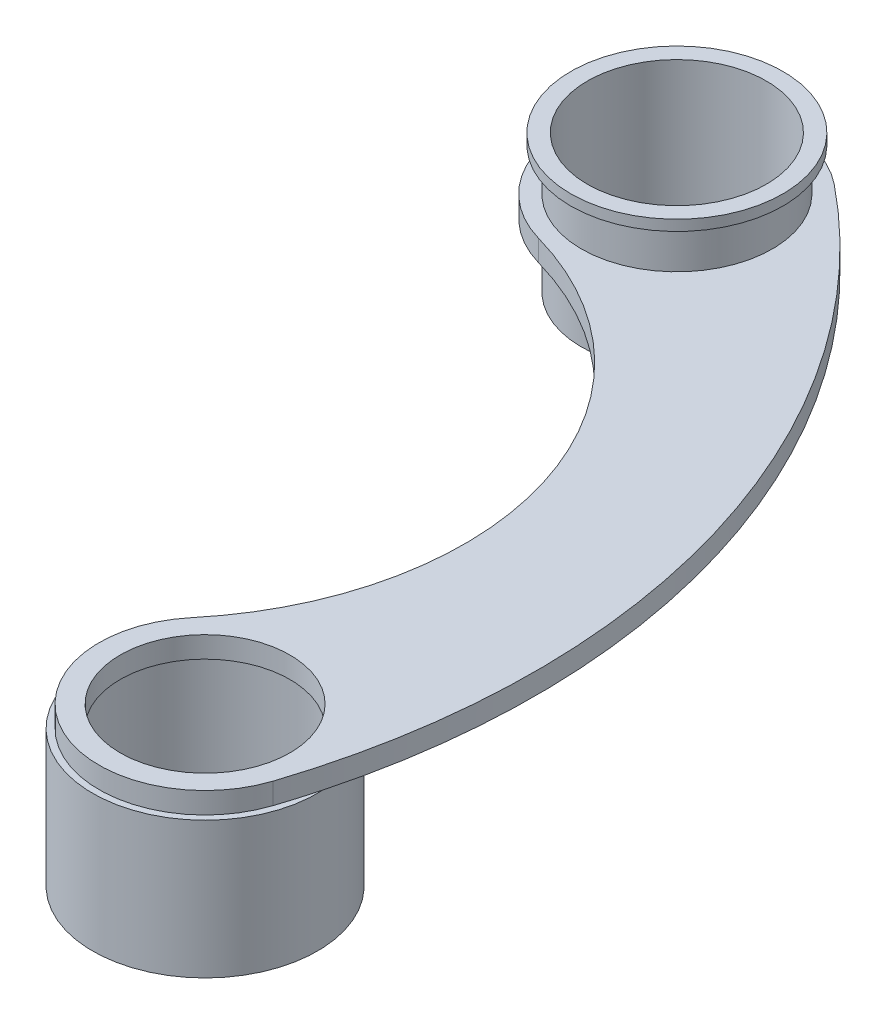
ISO-10303-21;
HEADER;
FILE_DESCRIPTION(('STEP AP214'),'2;1');
FILE_NAME('part.step','',(''),(''),'','','');
FILE_SCHEMA(('AUTOMOTIVE_DESIGN { 1 0 10303 214 1 1 1 1 }'));
ENDSEC;
DATA;
#1=APPLICATION_CONTEXT('core data for automotive mechanical design processes');
#2=APPLICATION_PROTOCOL_DEFINITION('international standard','automotive_design',2000,#1);
#3=PRODUCT_CONTEXT('',#1,'mechanical');
#4=PRODUCT('Part','Part','',(#3));
#5=PRODUCT_RELATED_PRODUCT_CATEGORY('part','',(#4));
#6=PRODUCT_DEFINITION_FORMATION('','',#4);
#7=PRODUCT_DEFINITION_CONTEXT('part definition',#1,'design');
#8=PRODUCT_DEFINITION('design','',#6,#7);
#9=PRODUCT_DEFINITION_SHAPE('','',#8);
#10=(LENGTH_UNIT() NAMED_UNIT(*) SI_UNIT(.MILLI.,.METRE.));
#11=(NAMED_UNIT(*) PLANE_ANGLE_UNIT() SI_UNIT($,.RADIAN.));
#12=(NAMED_UNIT(*) SI_UNIT($,.STERADIAN.) SOLID_ANGLE_UNIT());
#13=UNCERTAINTY_MEASURE_WITH_UNIT(LENGTH_MEASURE(1.E-05),#10,'distance_accuracy_value','');
#14=(GEOMETRIC_REPRESENTATION_CONTEXT(3) GLOBAL_UNCERTAINTY_ASSIGNED_CONTEXT((#13)) GLOBAL_UNIT_ASSIGNED_CONTEXT((#10,
#11,#12)) REPRESENTATION_CONTEXT('',''));
#15=CARTESIAN_POINT('',(0.,0.,0.));
#16=DIRECTION('',(0.,0.,1.));
#17=DIRECTION('',(1.,0.,0.));
#18=AXIS2_PLACEMENT_3D('',#15,#16,#17);
#19=CARTESIAN_POINT('',(9.69812358716446,-0.1,31.9326861666704));
#20=DIRECTION('',(0.,-1.,0.));
#21=DIRECTION('',(0.,0.,-1.));
#22=AXIS2_PLACEMENT_3D('',#19,#20,#21);
#23=PLANE('',#22);
#24=CARTESIAN_POINT('',(9.69812358716446,-0.1,31.9326861666704));
#25=DIRECTION('',(0.,-1.,0.));
#26=DIRECTION('',(0.,0.,-1.));
#27=AXIS2_PLACEMENT_3D('',#24,#25,#26);
#28=CIRCLE('',#27,4.5);
#29=CARTESIAN_POINT('',(9.69812358716446,-0.1,27.4326861666704));
#30=VERTEX_POINT('',#29);
#31=EDGE_CURVE('E114',#30,#30,#28,.T.);
#32=ORIENTED_EDGE('',*,*,#31,.F.);
#33=EDGE_LOOP('',(#32));
#34=FACE_BOUND('',#33,.T.);
#35=CARTESIAN_POINT('',(9.69812358716446,-0.1,31.9326861666704));
#36=DIRECTION('',(0.,-1.,0.));
#37=DIRECTION('',(0.,0.,-1.));
#38=AXIS2_PLACEMENT_3D('',#35,#36,#37);
#39=CIRCLE('',#38,5.00000000000001);
#40=CARTESIAN_POINT('',(9.69812358716446,-0.1,26.9326861666704));
#41=VERTEX_POINT('',#40);
#42=EDGE_CURVE('E12',#41,#41,#39,.F.);
#43=ORIENTED_EDGE('',*,*,#42,.F.);
#44=EDGE_LOOP('',(#43));
#45=FACE_BOUND('',#44,.T.);
#46=ADVANCED_FACE('F47',(#34,#45),#23,.T.);
#47=CARTESIAN_POINT('',(-4.35036872643945,0.,27.3541172356111));
#48=DIRECTION('',(0.,1.,0.));
#49=DIRECTION('',(0.,0.,1.));
#50=AXIS2_PLACEMENT_3D('',#47,#48,#49);
#51=PLANE('',#50);
#52=CARTESIAN_POINT('',(9.69812358716446,0.,31.9326861666704));
#53=DIRECTION('',(0.,1.,0.));
#54=DIRECTION('',(0.,0.,1.));
#55=AXIS2_PLACEMENT_3D('',#52,#53,#54);
#56=CIRCLE('',#55,4.);
#57=CARTESIAN_POINT('',(9.69812358716446,0.,35.9326861666704));
#58=VERTEX_POINT('',#57);
#59=EDGE_CURVE('E144',#58,#58,#56,.T.);
#60=ORIENTED_EDGE('',*,*,#59,.T.);
#61=EDGE_LOOP('',(#60));
#62=FACE_BOUND('',#61,.T.);
#63=CARTESIAN_POINT('',(9.69812358716446,0.,31.9326861666704));
#64=DIRECTION('',(0.,-1.,0.));
#65=DIRECTION('',(0.,0.,-1.));
#66=AXIS2_PLACEMENT_3D('',#63,#64,#65);
#67=CIRCLE('',#66,4.5);
#68=CARTESIAN_POINT('',(9.69812358716446,0.,27.4326861666704));
#69=VERTEX_POINT('',#68);
#70=EDGE_CURVE('E384',#69,#69,#67,.T.);
#71=ORIENTED_EDGE('',*,*,#70,.T.);
#72=EDGE_LOOP('',(#71));
#73=FACE_BOUND('',#72,.T.);
#74=ADVANCED_FACE('F181',(#62,#73),#51,.F.);
#75=CARTESIAN_POINT('',(-4.35036872643945,1.,27.3541172356111));
#76=DIRECTION('',(0.,1.,0.));
#77=DIRECTION('',(0.,0.,1.));
#78=AXIS2_PLACEMENT_3D('',#75,#76,#77);
#79=PLANE('',#78);
#80=CARTESIAN_POINT('',(0.,1.,0.));
#81=DIRECTION('',(0.,1.,0.));
#82=DIRECTION('',(0.,0.,1.));
#83=AXIS2_PLACEMENT_3D('',#80,#81,#82);
#84=CIRCLE('',#83,4.5);
#85=CARTESIAN_POINT('',(0.,1.,4.5));
#86=VERTEX_POINT('',#85);
#87=EDGE_CURVE('E56',#86,#86,#84,.T.);
#88=ORIENTED_EDGE('',*,*,#87,.F.);
#89=EDGE_LOOP('',(#88));
#90=FACE_BOUND('',#89,.T.);
#91=CARTESIAN_POINT('',(9.69812358716446,1.,31.9326861666704));
#92=DIRECTION('',(0.,1.,0.));
#93=DIRECTION('',(0.,0.,1.));
#94=AXIS2_PLACEMENT_3D('',#91,#92,#93);
#95=CIRCLE('',#94,5.);
#96=CARTESIAN_POINT('',(5.85849379907024,1.,28.7299930670464));
#97=VERTEX_POINT('',#96);
#98=CARTESIAN_POINT('',(14.4520182011324,1.,33.4820363528086));
#99=VERTEX_POINT('',#98);
#100=EDGE_CURVE('E134',#97,#99,#95,.T.);
#101=ORIENTED_EDGE('',*,*,#100,.T.);
#102=CARTESIAN_POINT('',(-18.3988610400434,1.,22.7755483045518));
#103=DIRECTION('',(0.,1.,0.));
#104=DIRECTION('',(0.,0.,1.));
#105=AXIS2_PLACEMENT_3D('',#102,#103,#104);
#106=CIRCLE('',#105,34.5515434278381);
#107=CARTESIAN_POINT('',(3.31345958167143,1.,-4.10165925995602));
#108=VERTEX_POINT('',#107);
#109=EDGE_CURVE('E95',#99,#108,#106,.T.);
#110=ORIENTED_EDGE('',*,*,#109,.T.);
#111=CARTESIAN_POINT('',(0.,1.,0.));
#112=DIRECTION('',(0.,1.,0.));
#113=DIRECTION('',(0.,0.,1.));
#114=AXIS2_PLACEMENT_3D('',#111,#112,#113);
#115=CIRCLE('',#114,5.2728192728514);
#116=CARTESIAN_POINT('',(-1.44187506492091,1.,5.07184575685347));
#117=VERTEX_POINT('',#116);
#118=EDGE_CURVE('E166',#108,#117,#115,.T.);
#119=ORIENTED_EDGE('',*,*,#118,.T.);
#120=CARTESIAN_POINT('',(-5.47914827198229,1.,19.2730948682775));
#121=DIRECTION('',(0.,-1.,0.));
#122=DIRECTION('',(0.,0.,1.));
#123=AXIS2_PLACEMENT_3D('',#120,#121,#122);
#124=CIRCLE('',#123,14.7639781655615);
#125=EDGE_CURVE('E64',#117,#97,#124,.T.);
#126=ORIENTED_EDGE('',*,*,#125,.T.);
#127=EDGE_LOOP('',(#101,#110,#119,#126));
#128=FACE_BOUND('',#127,.T.);
#129=CARTESIAN_POINT('',(9.69812358716446,1.,31.9326861666704));
#130=DIRECTION('',(0.,1.,0.));
#131=DIRECTION('',(0.,0.,1.));
#132=AXIS2_PLACEMENT_3D('',#129,#130,#131);
#133=CIRCLE('',#132,4.);
#134=CARTESIAN_POINT('',(9.69812358716446,1.,35.9326861666704));
#135=VERTEX_POINT('',#134);
#136=EDGE_CURVE('E148',#135,#135,#133,.T.);
#137=ORIENTED_EDGE('',*,*,#136,.F.);
#138=EDGE_LOOP('',(#137));
#139=FACE_BOUND('',#138,.T.);
#140=ADVANCED_FACE('F168',(#90,#128,#139),#79,.T.);
#141=CARTESIAN_POINT('',(9.69812358716446,0.,31.9326861666704));
#142=DIRECTION('',(0.,-1.,0.));
#143=DIRECTION('',(0.,0.,-1.));
#144=AXIS2_PLACEMENT_3D('',#141,#142,#143);
#145=CIRCLE('',#144,5.3);
#146=CARTESIAN_POINT('',(6.77034485747711,0.,27.5147554621448));
#147=VERTEX_POINT('',#146);
#148=CARTESIAN_POINT('',(14.9910697764943,0.,31.6593354087439));
#149=VERTEX_POINT('',#148);
#150=EDGE_CURVE('E105',#147,#149,#145,.T.);
#151=ORIENTED_EDGE('',*,*,#150,.F.);
#152=CARTESIAN_POINT('',(-5.47914827198229,0.,19.2730948682775));
#153=DIRECTION('',(0.,-1.,0.));
#154=DIRECTION('',(0.,0.,1.));
#155=AXIS2_PLACEMENT_3D('',#152,#153,#154);
#156=CIRCLE('',#155,14.7639781655615);
#157=CARTESIAN_POINT('',(-1.44187506492091,0.,5.07184575685347));
#158=VERTEX_POINT('',#157);
#159=EDGE_CURVE('E132',#158,#147,#156,.T.);
#160=ORIENTED_EDGE('',*,*,#159,.F.);
#161=CARTESIAN_POINT('',(0.,0.,0.));
#162=DIRECTION('',(0.,1.,0.));
#163=DIRECTION('',(0.,0.,1.));
#164=AXIS2_PLACEMENT_3D('',#161,#162,#163);
#165=CIRCLE('',#164,5.2728192728514);
#166=CARTESIAN_POINT('',(3.31345958167143,0.,-4.10165925995602));
#167=VERTEX_POINT('',#166);
#168=EDGE_CURVE('E79',#167,#158,#165,.T.);
#169=ORIENTED_EDGE('',*,*,#168,.F.);
#170=CARTESIAN_POINT('',(-18.3988610400434,0.,22.7755483045518));
#171=DIRECTION('',(0.,1.,0.));
#172=DIRECTION('',(0.,0.,1.));
#173=AXIS2_PLACEMENT_3D('',#170,#171,#172);
#174=CIRCLE('',#173,34.5515434278381);
#175=EDGE_CURVE('E121',#149,#167,#174,.T.);
#176=ORIENTED_EDGE('',*,*,#175,.F.);
#177=EDGE_LOOP('',(#151,#160,#169,#176));
#178=FACE_BOUND('',#177,.T.);
#179=CARTESIAN_POINT('',(0.,0.,0.));
#180=DIRECTION('',(0.,1.,0.));
#181=DIRECTION('',(0.,0.,1.));
#182=AXIS2_PLACEMENT_3D('',#179,#180,#181);
#183=CIRCLE('',#182,4.5);
#184=CARTESIAN_POINT('',(0.,0.,4.5));
#185=VERTEX_POINT('',#184);
#186=EDGE_CURVE('E142',#185,#185,#183,.T.);
#187=ORIENTED_EDGE('',*,*,#186,.T.);
#188=EDGE_LOOP('',(#187));
#189=FACE_BOUND('',#188,.T.);
#190=ADVANCED_FACE('F122',(#178,#189),#51,.F.);
#191=CARTESIAN_POINT('',(9.69812358716446,1.,31.9326861666704));
#192=DIRECTION('',(0.,-1.,0.));
#193=DIRECTION('',(0.,0.,-1.));
#194=AXIS2_PLACEMENT_3D('',#191,#192,#193);
#195=CYLINDRICAL_SURFACE('',#194,5.);
#196=CARTESIAN_POINT('',(9.69812358716446,0.,31.9326861666704));
#197=DIRECTION('',(0.,1.,0.));
#198=DIRECTION('',(0.,0.,1.));
#199=AXIS2_PLACEMENT_3D('',#196,#197,#198);
#200=CIRCLE('',#199,5.);
#201=CARTESIAN_POINT('',(5.85849379907024,0.,28.7299930670464));
#202=VERTEX_POINT('',#201);
#203=CARTESIAN_POINT('',(14.4520182011324,0.,33.4820363528086));
#204=VERTEX_POINT('',#203);
#205=EDGE_CURVE('E87',#202,#204,#200,.T.);
#206=ORIENTED_EDGE('',*,*,#205,.T.);
#207=DIRECTION('',(0.,-1.,0.));
#208=VECTOR('',#207,1.);
#209=CARTESIAN_POINT('',(14.4520182011324,1.,33.4820363528086));
#210=LINE('',#209,#208);
#211=EDGE_CURVE('E127',#99,#204,#210,.T.);
#212=ORIENTED_EDGE('',*,*,#211,.F.);
#213=ORIENTED_EDGE('',*,*,#100,.F.);
#214=DIRECTION('',(0.,-1.,0.));
#215=VECTOR('',#214,1.);
#216=CARTESIAN_POINT('',(5.85849379907024,1.,28.7299930670464));
#217=LINE('',#216,#215);
#218=EDGE_CURVE('E135',#97,#202,#217,.T.);
#219=ORIENTED_EDGE('',*,*,#218,.T.);
#220=EDGE_LOOP('',(#206,#212,#213,#219));
#221=FACE_BOUND('',#220,.T.);
#222=ADVANCED_FACE('F49',(#221),#195,.T.);
#223=CARTESIAN_POINT('',(-18.3988610400434,1.,22.7755483045518));
#224=DIRECTION('',(0.,-1.,0.));
#225=DIRECTION('',(0.,0.,-1.));
#226=AXIS2_PLACEMENT_3D('',#223,#224,#225);
#227=CYLINDRICAL_SURFACE('',#226,34.5515434278381);
#228=EDGE_CURVE('E118',#204,#149,#174,.T.);
#229=ORIENTED_EDGE('',*,*,#228,.T.);
#230=ORIENTED_EDGE('',*,*,#175,.T.);
#231=DIRECTION('',(0.,-1.,0.));
#232=VECTOR('',#231,1.);
#233=CARTESIAN_POINT('',(3.31345958167143,1.,-4.10165925995602));
#234=LINE('',#233,#232);
#235=EDGE_CURVE('E140',#108,#167,#234,.T.);
#236=ORIENTED_EDGE('',*,*,#235,.F.);
#237=ORIENTED_EDGE('',*,*,#109,.F.);
#238=ORIENTED_EDGE('',*,*,#211,.T.);
#239=EDGE_LOOP('',(#229,#230,#236,#237,#238));
#240=FACE_BOUND('',#239,.T.);
#241=ADVANCED_FACE('F125',(#240),#227,.T.);
#242=CARTESIAN_POINT('',(0.,1.,0.));
#243=DIRECTION('',(0.,-1.,0.));
#244=DIRECTION('',(0.,0.,-1.));
#245=AXIS2_PLACEMENT_3D('',#242,#243,#244);
#246=CYLINDRICAL_SURFACE('',#245,5.2728192728514);
#247=ORIENTED_EDGE('',*,*,#168,.T.);
#248=DIRECTION('',(0.,-1.,0.));
#249=VECTOR('',#248,1.);
#250=CARTESIAN_POINT('',(-1.44187506492091,1.,5.07184575685347));
#251=LINE('',#250,#249);
#252=EDGE_CURVE('E138',#117,#158,#251,.T.);
#253=ORIENTED_EDGE('',*,*,#252,.F.);
#254=ORIENTED_EDGE('',*,*,#118,.F.);
#255=ORIENTED_EDGE('',*,*,#235,.T.);
#256=EDGE_LOOP('',(#247,#253,#254,#255));
#257=FACE_BOUND('',#256,.T.);
#258=ADVANCED_FACE('F170',(#257),#246,.T.);
#259=CARTESIAN_POINT('',(-5.47914827198229,1.,19.2730948682775));
#260=DIRECTION('',(0.,-1.,0.));
#261=DIRECTION('',(0.,0.,-1.));
#262=AXIS2_PLACEMENT_3D('',#259,#260,#261);
#263=CYLINDRICAL_SURFACE('',#262,14.7639781655615);
#264=ORIENTED_EDGE('',*,*,#159,.T.);
#265=EDGE_CURVE('E119',#147,#202,#156,.T.);
#266=ORIENTED_EDGE('',*,*,#265,.T.);
#267=ORIENTED_EDGE('',*,*,#218,.F.);
#268=ORIENTED_EDGE('',*,*,#125,.F.);
#269=ORIENTED_EDGE('',*,*,#252,.T.);
#270=EDGE_LOOP('',(#264,#266,#267,#268,#269));
#271=FACE_BOUND('',#270,.T.);
#272=ADVANCED_FACE('F172',(#271),#263,.F.);
#273=CARTESIAN_POINT('',(9.69812358716446,1.,31.9326861666704));
#274=DIRECTION('',(0.,-1.,0.));
#275=DIRECTION('',(0.,0.,-1.));
#276=AXIS2_PLACEMENT_3D('',#273,#274,#275);
#277=CYLINDRICAL_SURFACE('',#276,4.);
#278=ORIENTED_EDGE('',*,*,#136,.T.);
#279=EDGE_LOOP('',(#278));
#280=FACE_BOUND('',#279,.T.);
#281=ORIENTED_EDGE('',*,*,#59,.F.);
#282=EDGE_LOOP('',(#281));
#283=FACE_BOUND('',#282,.T.);
#284=ADVANCED_FACE('F221',(#280,#283),#277,.F.);
#285=CARTESIAN_POINT('',(0.,-3.,0.));
#286=DIRECTION('',(0.,1.,0.));
#287=DIRECTION('',(0.,0.,1.));
#288=AXIS2_PLACEMENT_3D('',#285,#286,#287);
#289=CYLINDRICAL_SURFACE('',#288,4.5);
#290=CARTESIAN_POINT('',(0.,-3.,0.));
#291=DIRECTION('',(0.,1.,0.));
#292=DIRECTION('',(0.,0.,1.));
#293=AXIS2_PLACEMENT_3D('',#290,#291,#292);
#294=CIRCLE('',#293,4.5);
#295=CARTESIAN_POINT('',(0.,-3.,4.5));
#296=VERTEX_POINT('',#295);
#297=EDGE_CURVE('E145',#296,#296,#294,.T.);
#298=ORIENTED_EDGE('',*,*,#297,.T.);
#299=EDGE_LOOP('',(#298));
#300=FACE_BOUND('',#299,.T.);
#301=ORIENTED_EDGE('',*,*,#186,.F.);
#302=EDGE_LOOP('',(#301));
#303=FACE_BOUND('',#302,.T.);
#304=ADVANCED_FACE('F216',(#300,#303),#289,.T.);
#305=CARTESIAN_POINT('',(0.,-3.,0.));
#306=DIRECTION('',(0.,1.,0.));
#307=DIRECTION('',(0.,0.,1.));
#308=AXIS2_PLACEMENT_3D('',#305,#306,#307);
#309=PLANE('',#308);
#310=CARTESIAN_POINT('',(0.,-3.,0.));
#311=DIRECTION('',(0.,1.,0.));
#312=DIRECTION('',(0.,0.,1.));
#313=AXIS2_PLACEMENT_3D('',#310,#311,#312);
#314=CIRCLE('',#313,4.21825541828112);
#315=CARTESIAN_POINT('',(0.,-3.,4.21825541828112));
#316=VERTEX_POINT('',#315);
#317=EDGE_CURVE('E151',#316,#316,#314,.T.);
#318=ORIENTED_EDGE('',*,*,#317,.T.);
#319=EDGE_LOOP('',(#318));
#320=FACE_BOUND('',#319,.T.);
#321=ORIENTED_EDGE('',*,*,#297,.F.);
#322=EDGE_LOOP('',(#321));
#323=FACE_BOUND('',#322,.T.);
#324=ADVANCED_FACE('F212',(#320,#323),#309,.F.);
#325=CARTESIAN_POINT('',(0.,1.,0.));
#326=DIRECTION('',(0.,-1.,0.));
#327=DIRECTION('',(0.,0.,-1.));
#328=AXIS2_PLACEMENT_3D('',#325,#326,#327);
#329=CYLINDRICAL_SURFACE('',#328,4.21825541828112);
#330=ORIENTED_EDGE('',*,*,#317,.F.);
#331=EDGE_LOOP('',(#330));
#332=FACE_BOUND('',#331,.T.);
#333=CARTESIAN_POINT('',(0.,3.5,0.));
#334=DIRECTION('',(0.,1.,0.));
#335=DIRECTION('',(0.,0.,1.));
#336=AXIS2_PLACEMENT_3D('',#333,#334,#335);
#337=CIRCLE('',#336,4.21825541828112);
#338=CARTESIAN_POINT('',(0.,3.5,4.21825541828112));
#339=VERTEX_POINT('',#338);
#340=EDGE_CURVE('E120',#339,#339,#337,.T.);
#341=ORIENTED_EDGE('',*,*,#340,.T.);
#342=EDGE_LOOP('',(#341));
#343=FACE_BOUND('',#342,.T.);
#344=ADVANCED_FACE('F215',(#332,#343),#329,.F.);
#345=ORIENTED_EDGE('',*,*,#87,.T.);
#346=EDGE_LOOP('',(#345));
#347=FACE_BOUND('',#346,.T.);
#348=CARTESIAN_POINT('',(0.,3.,0.));
#349=DIRECTION('',(0.,1.,0.));
#350=DIRECTION('',(0.,0.,1.));
#351=AXIS2_PLACEMENT_3D('',#348,#349,#350);
#352=CIRCLE('',#351,4.5);
#353=CARTESIAN_POINT('',(0.,3.,4.5));
#354=VERTEX_POINT('',#353);
#355=EDGE_CURVE('E156',#354,#354,#352,.T.);
#356=ORIENTED_EDGE('',*,*,#355,.F.);
#357=EDGE_LOOP('',(#356));
#358=FACE_BOUND('',#357,.T.);
#359=ADVANCED_FACE('F204',(#347,#358),#289,.T.);
#360=CARTESIAN_POINT('',(0.,3.5,0.));
#361=DIRECTION('',(0.,1.,0.));
#362=DIRECTION('',(0.,0.,1.));
#363=AXIS2_PLACEMENT_3D('',#360,#361,#362);
#364=PLANE('',#363);
#365=CARTESIAN_POINT('',(0.,3.5,0.));
#366=DIRECTION('',(0.,1.,0.));
#367=DIRECTION('',(0.,0.,1.));
#368=AXIS2_PLACEMENT_3D('',#365,#366,#367);
#369=CIRCLE('',#368,5.);
#370=CARTESIAN_POINT('',(0.,3.5,5.));
#371=VERTEX_POINT('',#370);
#372=EDGE_CURVE('E394',#371,#371,#369,.T.);
#373=ORIENTED_EDGE('',*,*,#372,.T.);
#374=EDGE_LOOP('',(#373));
#375=FACE_BOUND('',#374,.T.);
#376=ORIENTED_EDGE('',*,*,#340,.F.);
#377=EDGE_LOOP('',(#376));
#378=FACE_BOUND('',#377,.T.);
#379=ADVANCED_FACE('F200',(#375,#378),#364,.T.);
#380=CARTESIAN_POINT('',(0.,3.,0.));
#381=DIRECTION('',(0.,1.,0.));
#382=DIRECTION('',(0.,0.,1.));
#383=AXIS2_PLACEMENT_3D('',#380,#381,#382);
#384=PLANE('',#383);
#385=ORIENTED_EDGE('',*,*,#355,.T.);
#386=EDGE_LOOP('',(#385));
#387=FACE_BOUND('',#386,.T.);
#388=CARTESIAN_POINT('',(0.,3.,0.));
#389=DIRECTION('',(0.,1.,0.));
#390=DIRECTION('',(0.,0.,1.));
#391=AXIS2_PLACEMENT_3D('',#388,#389,#390);
#392=CIRCLE('',#391,5.);
#393=CARTESIAN_POINT('',(0.,3.,5.));
#394=VERTEX_POINT('',#393);
#395=EDGE_CURVE('E393',#394,#394,#392,.T.);
#396=ORIENTED_EDGE('',*,*,#395,.F.);
#397=EDGE_LOOP('',(#396));
#398=FACE_BOUND('',#397,.T.);
#399=ADVANCED_FACE('F203',(#387,#398),#384,.F.);
#400=CARTESIAN_POINT('',(0.,3.5,0.));
#401=DIRECTION('',(0.,-1.,0.));
#402=DIRECTION('',(0.,0.,-1.));
#403=AXIS2_PLACEMENT_3D('',#400,#401,#402);
#404=CYLINDRICAL_SURFACE('',#403,5.);
#405=ORIENTED_EDGE('',*,*,#372,.F.);
#406=EDGE_LOOP('',(#405));
#407=FACE_BOUND('',#406,.T.);
#408=ORIENTED_EDGE('',*,*,#395,.T.);
#409=EDGE_LOOP('',(#408));
#410=FACE_BOUND('',#409,.T.);
#411=ADVANCED_FACE('F197',(#407,#410),#404,.T.);
#412=CARTESIAN_POINT('',(9.69812358716446,0.,31.9326861666704));
#413=DIRECTION('',(0.,-1.,0.));
#414=DIRECTION('',(0.,0.,-1.));
#415=AXIS2_PLACEMENT_3D('',#412,#413,#414);
#416=PLANE('',#415);
#417=EDGE_CURVE('E109',#149,#147,#145,.T.);
#418=ORIENTED_EDGE('',*,*,#417,.F.);
#419=ORIENTED_EDGE('',*,*,#228,.F.);
#420=ORIENTED_EDGE('',*,*,#205,.F.);
#421=ORIENTED_EDGE('',*,*,#265,.F.);
#422=EDGE_LOOP('',(#418,#419,#420,#421));
#423=FACE_BOUND('',#422,.T.);
#424=ADVANCED_FACE('F116',(#423),#416,.F.);
#425=CARTESIAN_POINT('',(9.69812358716446,-0.1,31.9326861666704));
#426=DIRECTION('',(0.,1.,0.));
#427=DIRECTION('',(0.,0.,1.));
#428=AXIS2_PLACEMENT_3D('',#425,#426,#427);
#429=CYLINDRICAL_SURFACE('',#428,5.3);
#430=ORIENTED_EDGE('',*,*,#417,.T.);
#431=ORIENTED_EDGE('',*,*,#150,.T.);
#432=EDGE_LOOP('',(#430,#431));
#433=FACE_BOUND('',#432,.T.);
#434=CARTESIAN_POINT('',(9.69812358716446,-6.43792063891978,31.9326861666704));
#435=DIRECTION('',(0.,-1.,0.));
#436=DIRECTION('',(0.,0.,-1.));
#437=AXIS2_PLACEMENT_3D('',#434,#435,#436);
#438=CIRCLE('',#437,5.3);
#439=CARTESIAN_POINT('',(9.69812358716446,-6.43792063891978,26.6326861666704));
#440=VERTEX_POINT('',#439);
#441=EDGE_CURVE('E381',#440,#440,#438,.T.);
#442=ORIENTED_EDGE('',*,*,#441,.F.);
#443=EDGE_LOOP('',(#442));
#444=FACE_BOUND('',#443,.T.);
#445=ADVANCED_FACE('F107',(#433,#444),#429,.T.);
#446=CARTESIAN_POINT('',(9.69812358716446,-0.1,31.9326861666704));
#447=DIRECTION('',(0.,1.,0.));
#448=DIRECTION('',(0.,0.,1.));
#449=AXIS2_PLACEMENT_3D('',#446,#447,#448);
#450=CYLINDRICAL_SURFACE('',#449,4.5);
#451=ORIENTED_EDGE('',*,*,#31,.T.);
#452=EDGE_LOOP('',(#451));
#453=FACE_BOUND('',#452,.T.);
#454=ORIENTED_EDGE('',*,*,#70,.F.);
#455=EDGE_LOOP('',(#454));
#456=FACE_BOUND('',#455,.T.);
#457=ADVANCED_FACE('F193',(#453,#456),#450,.F.);
#458=CARTESIAN_POINT('',(9.69812358716446,-6.43792063891978,31.9326861666704));
#459=DIRECTION('',(0.,-1.,0.));
#460=DIRECTION('',(0.,0.,-1.));
#461=AXIS2_PLACEMENT_3D('',#458,#459,#460);
#462=PLANE('',#461);
#463=ORIENTED_EDGE('',*,*,#441,.T.);
#464=EDGE_LOOP('',(#463));
#465=FACE_BOUND('',#464,.T.);
#466=CARTESIAN_POINT('',(9.69812358716446,-6.43792063891978,31.9326861666704));
#467=DIRECTION('',(0.,-1.,0.));
#468=DIRECTION('',(0.,0.,-1.));
#469=AXIS2_PLACEMENT_3D('',#466,#467,#468);
#470=CIRCLE('',#469,5.00000000000001);
#471=CARTESIAN_POINT('',(9.69812358716446,-6.43792063891978,26.9326861666704));
#472=VERTEX_POINT('',#471);
#473=EDGE_CURVE('E378',#472,#472,#470,.T.);
#474=ORIENTED_EDGE('',*,*,#473,.F.);
#475=EDGE_LOOP('',(#474));
#476=FACE_BOUND('',#475,.T.);
#477=ADVANCED_FACE('F292',(#465,#476),#462,.T.);
#478=CARTESIAN_POINT('',(9.69812358716446,-6.43792063891978,31.9326861666704));
#479=DIRECTION('',(0.,1.,0.));
#480=DIRECTION('',(0.,0.,1.));
#481=AXIS2_PLACEMENT_3D('',#478,#479,#480);
#482=CYLINDRICAL_SURFACE('',#481,5.00000000000001);
#483=ORIENTED_EDGE('',*,*,#473,.T.);
#484=EDGE_LOOP('',(#483));
#485=FACE_BOUND('',#484,.T.);
#486=ORIENTED_EDGE('',*,*,#42,.T.);
#487=EDGE_LOOP('',(#486));
#488=FACE_BOUND('',#487,.T.);
#489=ADVANCED_FACE('F298',(#485,#488),#482,.F.);
#490=CLOSED_SHELL('',(#46,#74,#140,#190,#222,#241,#258,#272,#284,#304,#324,#344,#359,#379,#399,
#411,#424,#445,#457,#477,#489));
#491=MANIFOLD_SOLID_BREP('B2',#490);
#492=ADVANCED_BREP_SHAPE_REPRESENTATION('',(#18,#491),#14);
#493=SHAPE_DEFINITION_REPRESENTATION(#9,#492);
ENDSEC;
END-ISO-10303-21;
